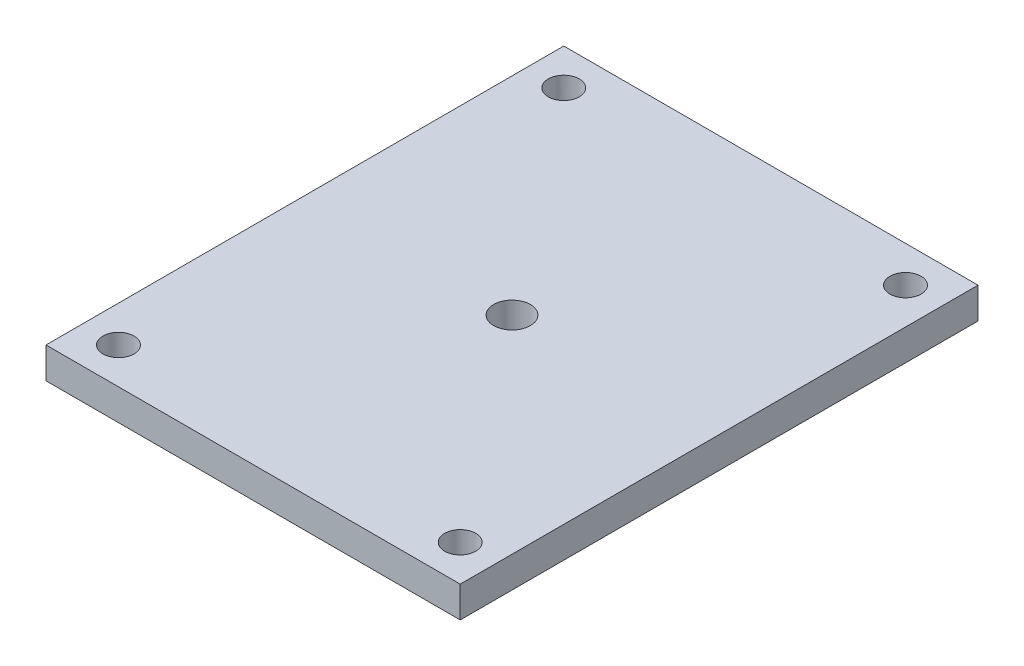
ISO-10303-21;
HEADER;
FILE_DESCRIPTION(('STEP AP214'),'2;1');
FILE_NAME('part.step','',(''),(''),'','','');
FILE_SCHEMA(('AUTOMOTIVE_DESIGN { 1 0 10303 214 1 1 1 1 }'));
ENDSEC;
DATA;
#1=APPLICATION_CONTEXT('core data for automotive mechanical design processes');
#2=APPLICATION_PROTOCOL_DEFINITION('international standard','automotive_design',2000,#1);
#3=PRODUCT_CONTEXT('',#1,'mechanical');
#4=PRODUCT('Part','Part','',(#3));
#5=PRODUCT_RELATED_PRODUCT_CATEGORY('part','',(#4));
#6=PRODUCT_DEFINITION_FORMATION('','',#4);
#7=PRODUCT_DEFINITION_CONTEXT('part definition',#1,'design');
#8=PRODUCT_DEFINITION('design','',#6,#7);
#9=PRODUCT_DEFINITION_SHAPE('','',#8);
#10=(LENGTH_UNIT() NAMED_UNIT(*) SI_UNIT(.MILLI.,.METRE.));
#11=(NAMED_UNIT(*) PLANE_ANGLE_UNIT() SI_UNIT($,.RADIAN.));
#12=(NAMED_UNIT(*) SI_UNIT($,.STERADIAN.) SOLID_ANGLE_UNIT());
#13=UNCERTAINTY_MEASURE_WITH_UNIT(LENGTH_MEASURE(1.E-05),#10,'distance_accuracy_value','');
#14=(GEOMETRIC_REPRESENTATION_CONTEXT(3) GLOBAL_UNCERTAINTY_ASSIGNED_CONTEXT((#13)) GLOBAL_UNIT_ASSIGNED_CONTEXT((#10,
#11,#12)) REPRESENTATION_CONTEXT('',''));
#15=CARTESIAN_POINT('',(0.,0.,0.));
#16=DIRECTION('',(0.,0.,1.));
#17=DIRECTION('',(1.,0.,0.));
#18=AXIS2_PLACEMENT_3D('',#15,#16,#17);
#19=CARTESIAN_POINT('',(254.,38.1,317.5));
#20=DIRECTION('',(-1.,0.,0.));
#21=DIRECTION('',(0.,0.,1.));
#22=AXIS2_PLACEMENT_3D('',#19,#20,#21);
#23=PLANE('',#22);
#24=DIRECTION('',(0.,0.,-1.));
#25=VECTOR('',#24,1.);
#26=CARTESIAN_POINT('',(254.,0.,317.5));
#27=LINE('',#26,#25);
#28=CARTESIAN_POINT('',(254.,0.,317.5));
#29=VERTEX_POINT('',#28);
#30=CARTESIAN_POINT('',(254.,0.,-317.5));
#31=VERTEX_POINT('',#30);
#32=EDGE_CURVE('E100',#29,#31,#27,.T.);
#33=ORIENTED_EDGE('',*,*,#32,.T.);
#34=DIRECTION('',(0.,-1.,0.));
#35=VECTOR('',#34,1.);
#36=CARTESIAN_POINT('',(254.,38.1,-317.5));
#37=LINE('',#36,#35);
#38=CARTESIAN_POINT('',(254.,38.1,-317.5));
#39=VERTEX_POINT('',#38);
#40=EDGE_CURVE('E11',#39,#31,#37,.T.);
#41=ORIENTED_EDGE('',*,*,#40,.F.);
#42=DIRECTION('',(0.,0.,-1.));
#43=VECTOR('',#42,1.);
#44=CARTESIAN_POINT('',(254.,38.1,317.5));
#45=LINE('',#44,#43);
#46=CARTESIAN_POINT('',(254.,38.1,317.5));
#47=VERTEX_POINT('',#46);
#48=EDGE_CURVE('E88',#47,#39,#45,.T.);
#49=ORIENTED_EDGE('',*,*,#48,.F.);
#50=DIRECTION('',(0.,-1.,0.));
#51=VECTOR('',#50,1.);
#52=CARTESIAN_POINT('',(254.,38.1,317.5));
#53=LINE('',#52,#51);
#54=EDGE_CURVE('E96',#47,#29,#53,.T.);
#55=ORIENTED_EDGE('',*,*,#54,.T.);
#56=EDGE_LOOP('',(#33,#41,#49,#55));
#57=FACE_BOUND('',#56,.T.);
#58=ADVANCED_FACE('F37',(#57),#23,.F.);
#59=CARTESIAN_POINT('',(-254.,38.1,-317.5));
#60=DIRECTION('',(0.,0.,1.));
#61=DIRECTION('',(1.,0.,0.));
#62=AXIS2_PLACEMENT_3D('',#59,#60,#61);
#63=PLANE('',#62);
#64=DIRECTION('',(-1.,0.,0.));
#65=VECTOR('',#64,1.);
#66=CARTESIAN_POINT('',(-254.,0.,-317.5));
#67=LINE('',#66,#65);
#68=CARTESIAN_POINT('',(-254.,0.,-317.5));
#69=VERTEX_POINT('',#68);
#70=EDGE_CURVE('E92',#31,#69,#67,.T.);
#71=ORIENTED_EDGE('',*,*,#70,.T.);
#72=DIRECTION('',(0.,-1.,0.));
#73=VECTOR('',#72,1.);
#74=CARTESIAN_POINT('',(-254.,38.1,-317.5));
#75=LINE('',#74,#73);
#76=CARTESIAN_POINT('',(-254.,38.1,-317.5));
#77=VERTEX_POINT('',#76);
#78=EDGE_CURVE('E45',#77,#69,#75,.T.);
#79=ORIENTED_EDGE('',*,*,#78,.F.);
#80=DIRECTION('',(-1.,0.,0.));
#81=VECTOR('',#80,1.);
#82=CARTESIAN_POINT('',(-254.,38.1,-317.5));
#83=LINE('',#82,#81);
#84=EDGE_CURVE('E83',#39,#77,#83,.T.);
#85=ORIENTED_EDGE('',*,*,#84,.F.);
#86=ORIENTED_EDGE('',*,*,#40,.T.);
#87=EDGE_LOOP('',(#71,#79,#85,#86));
#88=FACE_BOUND('',#87,.T.);
#89=ADVANCED_FACE('F91',(#88),#63,.F.);
#90=CARTESIAN_POINT('',(-254.,38.1,317.5));
#91=DIRECTION('',(1.,0.,0.));
#92=DIRECTION('',(0.,0.,-1.));
#93=AXIS2_PLACEMENT_3D('',#90,#91,#92);
#94=PLANE('',#93);
#95=DIRECTION('',(0.,0.,1.));
#96=VECTOR('',#95,1.);
#97=CARTESIAN_POINT('',(-254.,0.,317.5));
#98=LINE('',#97,#96);
#99=CARTESIAN_POINT('',(-254.,0.,317.5));
#100=VERTEX_POINT('',#99);
#101=EDGE_CURVE('E70',#69,#100,#98,.T.);
#102=ORIENTED_EDGE('',*,*,#101,.T.);
#103=DIRECTION('',(0.,-1.,0.));
#104=VECTOR('',#103,1.);
#105=CARTESIAN_POINT('',(-254.,38.1,317.5));
#106=LINE('',#105,#104);
#107=CARTESIAN_POINT('',(-254.,38.1,317.5));
#108=VERTEX_POINT('',#107);
#109=EDGE_CURVE('E93',#108,#100,#106,.T.);
#110=ORIENTED_EDGE('',*,*,#109,.F.);
#111=DIRECTION('',(0.,0.,1.));
#112=VECTOR('',#111,1.);
#113=CARTESIAN_POINT('',(-254.,38.1,317.5));
#114=LINE('',#113,#112);
#115=EDGE_CURVE('E86',#77,#108,#114,.T.);
#116=ORIENTED_EDGE('',*,*,#115,.F.);
#117=ORIENTED_EDGE('',*,*,#78,.T.);
#118=EDGE_LOOP('',(#102,#110,#116,#117));
#119=FACE_BOUND('',#118,.T.);
#120=ADVANCED_FACE('F94',(#119),#94,.F.);
#121=CARTESIAN_POINT('',(-254.,38.1,317.5));
#122=DIRECTION('',(0.,0.,-1.));
#123=DIRECTION('',(-1.,0.,0.));
#124=AXIS2_PLACEMENT_3D('',#121,#122,#123);
#125=PLANE('',#124);
#126=DIRECTION('',(1.,0.,0.));
#127=VECTOR('',#126,1.);
#128=CARTESIAN_POINT('',(-254.,0.,317.5));
#129=LINE('',#128,#127);
#130=EDGE_CURVE('E76',#100,#29,#129,.T.);
#131=ORIENTED_EDGE('',*,*,#130,.T.);
#132=ORIENTED_EDGE('',*,*,#54,.F.);
#133=DIRECTION('',(1.,0.,0.));
#134=VECTOR('',#133,1.);
#135=CARTESIAN_POINT('',(-254.,38.1,317.5));
#136=LINE('',#135,#134);
#137=EDGE_CURVE('E53',#108,#47,#136,.T.);
#138=ORIENTED_EDGE('',*,*,#137,.F.);
#139=ORIENTED_EDGE('',*,*,#109,.T.);
#140=EDGE_LOOP('',(#131,#132,#138,#139));
#141=FACE_BOUND('',#140,.T.);
#142=ADVANCED_FACE('F108',(#141),#125,.F.);
#143=CARTESIAN_POINT('',(0.,38.1,0.));
#144=DIRECTION('',(0.,-1.,0.));
#145=DIRECTION('',(0.,0.,-1.));
#146=AXIS2_PLACEMENT_3D('',#143,#144,#145);
#147=PLANE('',#146);
#148=CARTESIAN_POINT('',(0.,38.1,0.));
#149=DIRECTION('',(0.,1.,0.));
#150=DIRECTION('',(0.,0.,1.));
#151=AXIS2_PLACEMENT_3D('',#148,#149,#150);
#152=CIRCLE('',#151,22.5);
#153=CARTESIAN_POINT('',(0.,38.1,22.5));
#154=VERTEX_POINT('',#153);
#155=EDGE_CURVE('E140',#154,#154,#152,.T.);
#156=ORIENTED_EDGE('',*,*,#155,.F.);
#157=EDGE_LOOP('',(#156));
#158=FACE_BOUND('',#157,.T.);
#159=CARTESIAN_POINT('',(209.55,38.1,-273.05));
#160=DIRECTION('',(0.,1.,0.));
#161=DIRECTION('',(0.,0.,-1.));
#162=AXIS2_PLACEMENT_3D('',#159,#160,#161);
#163=CIRCLE('',#162,19.05);
#164=CARTESIAN_POINT('',(209.55,38.1,-292.1));
#165=VERTEX_POINT('',#164);
#166=EDGE_CURVE('E131',#165,#165,#163,.T.);
#167=ORIENTED_EDGE('',*,*,#166,.F.);
#168=EDGE_LOOP('',(#167));
#169=FACE_BOUND('',#168,.T.);
#170=CARTESIAN_POINT('',(209.55,38.1,273.05));
#171=DIRECTION('',(0.,1.,0.));
#172=DIRECTION('',(0.,0.,1.));
#173=AXIS2_PLACEMENT_3D('',#170,#171,#172);
#174=CIRCLE('',#173,19.05);
#175=CARTESIAN_POINT('',(209.55,38.1,292.1));
#176=VERTEX_POINT('',#175);
#177=EDGE_CURVE('E123',#176,#176,#174,.T.);
#178=ORIENTED_EDGE('',*,*,#177,.F.);
#179=EDGE_LOOP('',(#178));
#180=FACE_BOUND('',#179,.T.);
#181=CARTESIAN_POINT('',(-209.55,38.1,273.05));
#182=DIRECTION('',(0.,1.,0.));
#183=DIRECTION('',(0.,0.,-1.));
#184=AXIS2_PLACEMENT_3D('',#181,#182,#183);
#185=CIRCLE('',#184,19.05);
#186=CARTESIAN_POINT('',(-209.55,38.1,254.));
#187=VERTEX_POINT('',#186);
#188=EDGE_CURVE('E124',#187,#187,#185,.T.);
#189=ORIENTED_EDGE('',*,*,#188,.F.);
#190=EDGE_LOOP('',(#189));
#191=FACE_BOUND('',#190,.T.);
#192=CARTESIAN_POINT('',(-209.55,38.1,-273.05));
#193=DIRECTION('',(0.,1.,0.));
#194=DIRECTION('',(0.,0.,1.));
#195=AXIS2_PLACEMENT_3D('',#192,#193,#194);
#196=CIRCLE('',#195,19.05);
#197=CARTESIAN_POINT('',(-209.55,38.1,-254.));
#198=VERTEX_POINT('',#197);
#199=EDGE_CURVE('E116',#198,#198,#196,.T.);
#200=ORIENTED_EDGE('',*,*,#199,.F.);
#201=EDGE_LOOP('',(#200));
#202=FACE_BOUND('',#201,.T.);
#203=ORIENTED_EDGE('',*,*,#48,.T.);
#204=ORIENTED_EDGE('',*,*,#84,.T.);
#205=ORIENTED_EDGE('',*,*,#115,.T.);
#206=ORIENTED_EDGE('',*,*,#137,.T.);
#207=EDGE_LOOP('',(#203,#204,#205,#206));
#208=FACE_BOUND('',#207,.T.);
#209=ADVANCED_FACE('F84',(#158,#169,#180,#191,#202,#208),#147,.F.);
#210=CARTESIAN_POINT('',(0.,0.,0.));
#211=DIRECTION('',(0.,-1.,0.));
#212=DIRECTION('',(0.,0.,-1.));
#213=AXIS2_PLACEMENT_3D('',#210,#211,#212);
#214=PLANE('',#213);
#215=CARTESIAN_POINT('',(0.,0.,0.));
#216=DIRECTION('',(0.,-1.,0.));
#217=DIRECTION('',(0.,0.,-1.));
#218=AXIS2_PLACEMENT_3D('',#215,#216,#217);
#219=CIRCLE('',#218,22.5);
#220=CARTESIAN_POINT('',(0.,0.,-22.5));
#221=VERTEX_POINT('',#220);
#222=EDGE_CURVE('E127',#221,#221,#219,.F.);
#223=ORIENTED_EDGE('',*,*,#222,.T.);
#224=EDGE_LOOP('',(#223));
#225=FACE_BOUND('',#224,.T.);
#226=CARTESIAN_POINT('',(209.55,0.,-273.05));
#227=DIRECTION('',(0.,-1.,0.));
#228=DIRECTION('',(0.,0.,-1.));
#229=AXIS2_PLACEMENT_3D('',#226,#227,#228);
#230=CIRCLE('',#229,19.05);
#231=CARTESIAN_POINT('',(209.55,0.,-292.1));
#232=VERTEX_POINT('',#231);
#233=EDGE_CURVE('E119',#232,#232,#230,.F.);
#234=ORIENTED_EDGE('',*,*,#233,.T.);
#235=EDGE_LOOP('',(#234));
#236=FACE_BOUND('',#235,.T.);
#237=CARTESIAN_POINT('',(209.55,0.,273.05));
#238=DIRECTION('',(0.,-1.,0.));
#239=DIRECTION('',(0.,0.,-1.));
#240=AXIS2_PLACEMENT_3D('',#237,#238,#239);
#241=CIRCLE('',#240,19.05);
#242=CARTESIAN_POINT('',(209.55,0.,254.));
#243=VERTEX_POINT('',#242);
#244=EDGE_CURVE('E128',#243,#243,#241,.F.);
#245=ORIENTED_EDGE('',*,*,#244,.T.);
#246=EDGE_LOOP('',(#245));
#247=FACE_BOUND('',#246,.T.);
#248=CARTESIAN_POINT('',(-209.55,0.,273.05));
#249=DIRECTION('',(0.,-1.,0.));
#250=DIRECTION('',(0.,0.,-1.));
#251=AXIS2_PLACEMENT_3D('',#248,#249,#250);
#252=CIRCLE('',#251,19.05);
#253=CARTESIAN_POINT('',(-209.55,0.,254.));
#254=VERTEX_POINT('',#253);
#255=EDGE_CURVE('E120',#254,#254,#252,.F.);
#256=ORIENTED_EDGE('',*,*,#255,.T.);
#257=EDGE_LOOP('',(#256));
#258=FACE_BOUND('',#257,.T.);
#259=CARTESIAN_POINT('',(-209.55,0.,-273.05));
#260=DIRECTION('',(0.,-1.,0.));
#261=DIRECTION('',(0.,0.,-1.));
#262=AXIS2_PLACEMENT_3D('',#259,#260,#261);
#263=CIRCLE('',#262,19.05);
#264=CARTESIAN_POINT('',(-209.55,0.,-292.1));
#265=VERTEX_POINT('',#264);
#266=EDGE_CURVE('E103',#265,#265,#263,.F.);
#267=ORIENTED_EDGE('',*,*,#266,.T.);
#268=EDGE_LOOP('',(#267));
#269=FACE_BOUND('',#268,.T.);
#270=ORIENTED_EDGE('',*,*,#32,.F.);
#271=ORIENTED_EDGE('',*,*,#130,.F.);
#272=ORIENTED_EDGE('',*,*,#101,.F.);
#273=ORIENTED_EDGE('',*,*,#70,.F.);
#274=EDGE_LOOP('',(#270,#271,#272,#273));
#275=FACE_BOUND('',#274,.T.);
#276=ADVANCED_FACE('F111',(#225,#236,#247,#258,#269,#275),#214,.T.);
#277=CARTESIAN_POINT('',(-209.55,-53.881536726415,-273.05));
#278=DIRECTION('',(0.,1.,0.));
#279=DIRECTION('',(0.,0.,1.));
#280=AXIS2_PLACEMENT_3D('',#277,#278,#279);
#281=CYLINDRICAL_SURFACE('',#280,19.05);
#282=ORIENTED_EDGE('',*,*,#199,.T.);
#283=EDGE_LOOP('',(#282));
#284=FACE_BOUND('',#283,.T.);
#285=ORIENTED_EDGE('',*,*,#266,.F.);
#286=EDGE_LOOP('',(#285));
#287=FACE_BOUND('',#286,.T.);
#288=ADVANCED_FACE('F158',(#284,#287),#281,.F.);
#289=CARTESIAN_POINT('',(-209.55,-53.881536726415,273.05));
#290=DIRECTION('',(0.,1.,0.));
#291=DIRECTION('',(0.,0.,1.));
#292=AXIS2_PLACEMENT_3D('',#289,#290,#291);
#293=CYLINDRICAL_SURFACE('',#292,19.05);
#294=ORIENTED_EDGE('',*,*,#188,.T.);
#295=EDGE_LOOP('',(#294));
#296=FACE_BOUND('',#295,.T.);
#297=ORIENTED_EDGE('',*,*,#255,.F.);
#298=EDGE_LOOP('',(#297));
#299=FACE_BOUND('',#298,.T.);
#300=ADVANCED_FACE('F161',(#296,#299),#293,.F.);
#301=CARTESIAN_POINT('',(209.55,-53.881536726415,273.05));
#302=DIRECTION('',(0.,1.,0.));
#303=DIRECTION('',(0.,0.,1.));
#304=AXIS2_PLACEMENT_3D('',#301,#302,#303);
#305=CYLINDRICAL_SURFACE('',#304,19.05);
#306=ORIENTED_EDGE('',*,*,#177,.T.);
#307=EDGE_LOOP('',(#306));
#308=FACE_BOUND('',#307,.T.);
#309=ORIENTED_EDGE('',*,*,#244,.F.);
#310=EDGE_LOOP('',(#309));
#311=FACE_BOUND('',#310,.T.);
#312=ADVANCED_FACE('F215',(#308,#311),#305,.F.);
#313=CARTESIAN_POINT('',(209.55,-53.881536726415,-273.05));
#314=DIRECTION('',(0.,1.,0.));
#315=DIRECTION('',(0.,0.,1.));
#316=AXIS2_PLACEMENT_3D('',#313,#314,#315);
#317=CYLINDRICAL_SURFACE('',#316,19.05);
#318=ORIENTED_EDGE('',*,*,#166,.T.);
#319=EDGE_LOOP('',(#318));
#320=FACE_BOUND('',#319,.T.);
#321=ORIENTED_EDGE('',*,*,#233,.F.);
#322=EDGE_LOOP('',(#321));
#323=FACE_BOUND('',#322,.T.);
#324=ADVANCED_FACE('F196',(#320,#323),#317,.F.);
#325=CARTESIAN_POINT('',(0.,-63.6396103067893,0.));
#326=DIRECTION('',(0.,1.,0.));
#327=DIRECTION('',(0.,0.,1.));
#328=AXIS2_PLACEMENT_3D('',#325,#326,#327);
#329=CYLINDRICAL_SURFACE('',#328,22.5);
#330=ORIENTED_EDGE('',*,*,#155,.T.);
#331=EDGE_LOOP('',(#330));
#332=FACE_BOUND('',#331,.T.);
#333=ORIENTED_EDGE('',*,*,#222,.F.);
#334=EDGE_LOOP('',(#333));
#335=FACE_BOUND('',#334,.T.);
#336=ADVANCED_FACE('F144',(#332,#335),#329,.F.);
#337=CLOSED_SHELL('',(#58,#89,#120,#142,#209,#276,#288,#300,#312,#324,#336));
#338=MANIFOLD_SOLID_BREP('B2',#337);
#339=ADVANCED_BREP_SHAPE_REPRESENTATION('',(#18,#338),#14);
#340=SHAPE_DEFINITION_REPRESENTATION(#9,#339);
ENDSEC;
END-ISO-10303-21;
